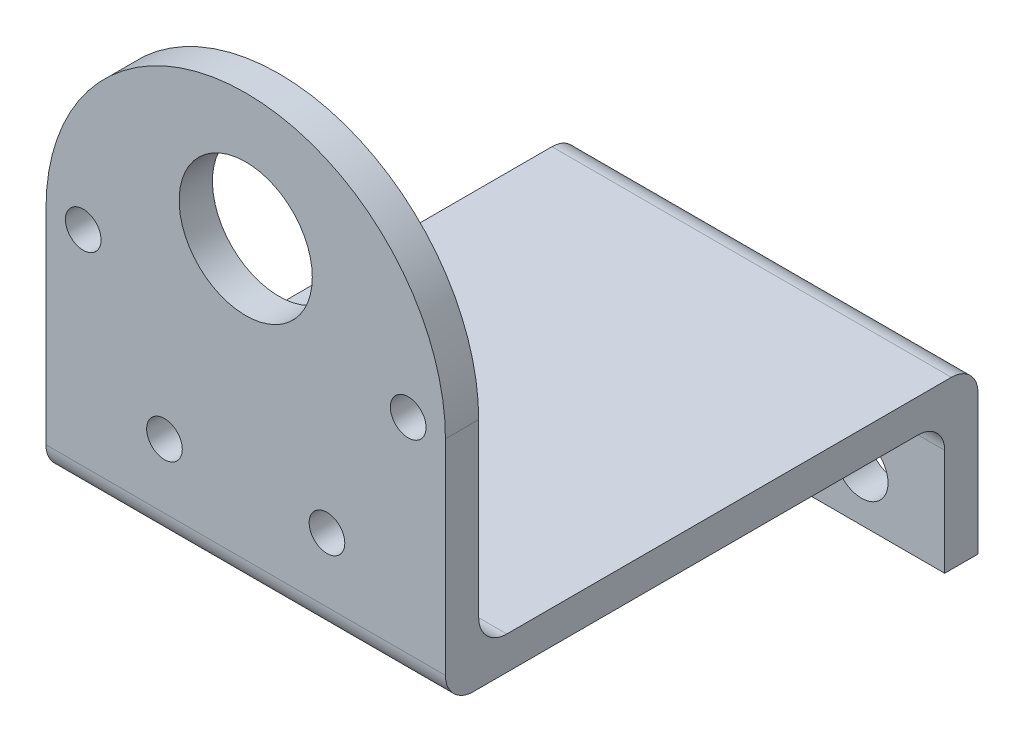
ISO-10303-21;
HEADER;
FILE_DESCRIPTION(('STEP AP214'),'2;1');
FILE_NAME('part.step','',(''),(''),'','','');
FILE_SCHEMA(('AUTOMOTIVE_DESIGN { 1 0 10303 214 1 1 1 1 }'));
ENDSEC;
DATA;
#1=APPLICATION_CONTEXT('core data for automotive mechanical design processes');
#2=APPLICATION_PROTOCOL_DEFINITION('international standard','automotive_design',2000,#1);
#3=PRODUCT_CONTEXT('',#1,'mechanical');
#4=PRODUCT('Part','Part','',(#3));
#5=PRODUCT_RELATED_PRODUCT_CATEGORY('part','',(#4));
#6=PRODUCT_DEFINITION_FORMATION('','',#4);
#7=PRODUCT_DEFINITION_CONTEXT('part definition',#1,'design');
#8=PRODUCT_DEFINITION('design','',#6,#7);
#9=PRODUCT_DEFINITION_SHAPE('','',#8);
#10=(LENGTH_UNIT() NAMED_UNIT(*) SI_UNIT(.MILLI.,.METRE.));
#11=(NAMED_UNIT(*) PLANE_ANGLE_UNIT() SI_UNIT($,.RADIAN.));
#12=(NAMED_UNIT(*) SI_UNIT($,.STERADIAN.) SOLID_ANGLE_UNIT());
#13=UNCERTAINTY_MEASURE_WITH_UNIT(LENGTH_MEASURE(1.E-05),#10,'distance_accuracy_value','');
#14=(GEOMETRIC_REPRESENTATION_CONTEXT(3) GLOBAL_UNCERTAINTY_ASSIGNED_CONTEXT((#13)) GLOBAL_UNIT_ASSIGNED_CONTEXT((#10,
#11,#12)) REPRESENTATION_CONTEXT('',''));
#15=CARTESIAN_POINT('',(0.,0.,0.));
#16=DIRECTION('',(0.,0.,1.));
#17=DIRECTION('',(1.,0.,0.));
#18=AXIS2_PLACEMENT_3D('',#15,#16,#17);
#19=CARTESIAN_POINT('',(38.1,42.094372260743,3.175));
#20=DIRECTION('',(0.,0.,-1.));
#21=DIRECTION('',(0.,1.,0.));
#22=AXIS2_PLACEMENT_3D('',#19,#20,#21);
#23=PLANE('',#22);
#24=CARTESIAN_POINT('',(3.55000000000001,23.044372260743,3.175));
#25=DIRECTION('',(0.,0.,1.));
#26=DIRECTION('',(1.,0.,0.));
#27=AXIS2_PLACEMENT_3D('',#24,#25,#26);
#28=CIRCLE('',#27,1.69999999999999);
#29=CARTESIAN_POINT('',(5.25,23.044372260743,3.175));
#30=VERTEX_POINT('',#29);
#31=EDGE_CURVE('E356',#30,#30,#28,.T.);
#32=ORIENTED_EDGE('',*,*,#31,.F.);
#33=EDGE_LOOP('',(#32));
#34=FACE_BOUND('',#33,.T.);
#35=CARTESIAN_POINT('',(26.8000000000001,9.62097850208426,3.175));
#36=DIRECTION('',(0.,0.,1.));
#37=DIRECTION('',(1.,0.,0.));
#38=AXIS2_PLACEMENT_3D('',#35,#36,#37);
#39=CIRCLE('',#38,1.69999999999999);
#40=CARTESIAN_POINT('',(28.5,9.62097850208426,3.175));
#41=VERTEX_POINT('',#40);
#42=EDGE_CURVE('E360',#41,#41,#39,.T.);
#43=ORIENTED_EDGE('',*,*,#42,.F.);
#44=EDGE_LOOP('',(#43));
#45=FACE_BOUND('',#44,.T.);
#46=CARTESIAN_POINT('',(11.3,9.62097850208421,3.175));
#47=DIRECTION('',(0.,0.,1.));
#48=DIRECTION('',(1.,0.,0.));
#49=AXIS2_PLACEMENT_3D('',#46,#47,#48);
#50=CIRCLE('',#49,1.69999999999999);
#51=CARTESIAN_POINT('',(13.,9.62097850208421,3.175));
#52=VERTEX_POINT('',#51);
#53=EDGE_CURVE('E270',#52,#52,#50,.T.);
#54=ORIENTED_EDGE('',*,*,#53,.F.);
#55=EDGE_LOOP('',(#54));
#56=FACE_BOUND('',#55,.T.);
#57=CARTESIAN_POINT('',(19.05,30.044372230743,3.17499999999999));
#58=DIRECTION('',(0.,0.,1.));
#59=DIRECTION('',(1.,0.,0.));
#60=AXIS2_PLACEMENT_3D('',#57,#58,#59);
#61=CIRCLE('',#60,6.35000000877115);
#62=CARTESIAN_POINT('',(25.4000000087711,30.044372230743,3.17499999999999));
#63=VERTEX_POINT('',#62);
#64=EDGE_CURVE('E259',#63,#63,#61,.T.);
#65=ORIENTED_EDGE('',*,*,#64,.F.);
#66=EDGE_LOOP('',(#65));
#67=FACE_BOUND('',#66,.T.);
#68=DIRECTION('',(0.,-1.,0.));
#69=VECTOR('',#68,1.);
#70=CARTESIAN_POINT('',(38.1,42.094372260743,3.175));
#71=LINE('',#70,#69);
#72=CARTESIAN_POINT('',(38.1,23.044372260743,3.17499999999999));
#73=VERTEX_POINT('',#72);
#74=CARTESIAN_POINT('',(38.1,3.50032880236569,3.17499999999999));
#75=VERTEX_POINT('',#74);
#76=EDGE_CURVE('E158',#73,#75,#71,.T.);
#77=ORIENTED_EDGE('',*,*,#76,.F.);
#78=CARTESIAN_POINT('',(19.05,23.044372260743,3.17499999999999));
#79=DIRECTION('',(0.,0.,1.));
#80=DIRECTION('',(1.,0.,0.));
#81=AXIS2_PLACEMENT_3D('',#78,#79,#80);
#82=CIRCLE('',#81,19.05);
#83=CARTESIAN_POINT('',(0.,23.044372260743,3.17499999999999));
#84=VERTEX_POINT('',#83);
#85=EDGE_CURVE('E258',#73,#84,#82,.T.);
#86=ORIENTED_EDGE('',*,*,#85,.T.);
#87=DIRECTION('',(0.,-1.,0.));
#88=VECTOR('',#87,1.);
#89=CARTESIAN_POINT('',(0.,42.094372260743,3.175));
#90=LINE('',#89,#88);
#91=CARTESIAN_POINT('',(0.,3.50032880236569,3.17499999999999));
#92=VERTEX_POINT('',#91);
#93=EDGE_CURVE('E213',#84,#92,#90,.T.);
#94=ORIENTED_EDGE('',*,*,#93,.T.);
#95=DIRECTION('',(-1.,0.,0.));
#96=VECTOR('',#95,1.);
#97=CARTESIAN_POINT('',(38.1,3.50032880236569,3.17499999999999));
#98=LINE('',#97,#96);
#99=EDGE_CURVE('E253',#75,#92,#98,.T.);
#100=ORIENTED_EDGE('',*,*,#99,.F.);
#101=EDGE_LOOP('',(#77,#86,#94,#100));
#102=FACE_BOUND('',#101,.T.);
#103=CARTESIAN_POINT('',(34.55,23.0443722607431,3.175));
#104=DIRECTION('',(0.,0.,1.));
#105=DIRECTION('',(1.,0.,0.));
#106=AXIS2_PLACEMENT_3D('',#103,#104,#105);
#107=CIRCLE('',#106,1.69999999999999);
#108=CARTESIAN_POINT('',(36.25,23.0443722607431,3.175));
#109=VERTEX_POINT('',#108);
#110=EDGE_CURVE('E370',#109,#109,#107,.T.);
#111=ORIENTED_EDGE('',*,*,#110,.F.);
#112=EDGE_LOOP('',(#111));
#113=FACE_BOUND('',#112,.T.);
#114=ADVANCED_FACE('F87',(#34,#45,#56,#67,#102,#113),#23,.F.);
#115=CARTESIAN_POINT('',(38.1,42.094372260743,0.));
#116=DIRECTION('',(0.,0.,-1.));
#117=DIRECTION('',(0.,1.,0.));
#118=AXIS2_PLACEMENT_3D('',#115,#116,#117);
#119=PLANE('',#118);
#120=CARTESIAN_POINT('',(3.55000000000001,23.044372260743,0.));
#121=DIRECTION('',(0.,0.,-1.));
#122=DIRECTION('',(0.,1.,0.));
#123=AXIS2_PLACEMENT_3D('',#120,#121,#122);
#124=CIRCLE('',#123,1.69999999999999);
#125=CARTESIAN_POINT('',(3.55000000000001,24.744372260743,0.));
#126=VERTEX_POINT('',#125);
#127=EDGE_CURVE('E373',#126,#126,#124,.T.);
#128=ORIENTED_EDGE('',*,*,#127,.F.);
#129=EDGE_LOOP('',(#128));
#130=FACE_BOUND('',#129,.T.);
#131=CARTESIAN_POINT('',(34.55,23.0443722607431,0.));
#132=DIRECTION('',(0.,0.,-1.));
#133=DIRECTION('',(0.,1.,0.));
#134=AXIS2_PLACEMENT_3D('',#131,#132,#133);
#135=CIRCLE('',#134,1.69999999999999);
#136=CARTESIAN_POINT('',(34.55,24.7443722607431,0.));
#137=VERTEX_POINT('',#136);
#138=EDGE_CURVE('E90',#137,#137,#135,.T.);
#139=ORIENTED_EDGE('',*,*,#138,.F.);
#140=EDGE_LOOP('',(#139));
#141=FACE_BOUND('',#140,.T.);
#142=CARTESIAN_POINT('',(26.8000000000001,9.62097850208426,0.));
#143=DIRECTION('',(0.,0.,-1.));
#144=DIRECTION('',(0.,1.,0.));
#145=AXIS2_PLACEMENT_3D('',#142,#143,#144);
#146=CIRCLE('',#145,1.69999999999999);
#147=CARTESIAN_POINT('',(26.8000000000001,11.3209785020842,0.));
#148=VERTEX_POINT('',#147);
#149=EDGE_CURVE('E365',#148,#148,#146,.T.);
#150=ORIENTED_EDGE('',*,*,#149,.F.);
#151=EDGE_LOOP('',(#150));
#152=FACE_BOUND('',#151,.T.);
#153=CARTESIAN_POINT('',(11.3,9.62097850208421,0.));
#154=DIRECTION('',(0.,0.,-1.));
#155=DIRECTION('',(0.,1.,0.));
#156=AXIS2_PLACEMENT_3D('',#153,#154,#155);
#157=CIRCLE('',#156,1.69999999999999);
#158=CARTESIAN_POINT('',(11.3,11.3209785020842,0.));
#159=VERTEX_POINT('',#158);
#160=EDGE_CURVE('E265',#159,#159,#157,.T.);
#161=ORIENTED_EDGE('',*,*,#160,.F.);
#162=EDGE_LOOP('',(#161));
#163=FACE_BOUND('',#162,.T.);
#164=CARTESIAN_POINT('',(19.05,30.044372230743,0.));
#165=DIRECTION('',(0.,0.,-1.));
#166=DIRECTION('',(0.,1.,0.));
#167=AXIS2_PLACEMENT_3D('',#164,#165,#166);
#168=CIRCLE('',#167,6.35000000877115);
#169=CARTESIAN_POINT('',(19.05,36.3943722395142,0.));
#170=VERTEX_POINT('',#169);
#171=EDGE_CURVE('E256',#170,#170,#168,.T.);
#172=ORIENTED_EDGE('',*,*,#171,.F.);
#173=EDGE_LOOP('',(#172));
#174=FACE_BOUND('',#173,.T.);
#175=CARTESIAN_POINT('',(19.05,23.044372260743,0.));
#176=DIRECTION('',(0.,0.,-1.));
#177=DIRECTION('',(0.,1.,0.));
#178=AXIS2_PLACEMENT_3D('',#175,#176,#177);
#179=CIRCLE('',#178,19.05);
#180=CARTESIAN_POINT('',(0.,23.044372260743,0.));
#181=VERTEX_POINT('',#180);
#182=CARTESIAN_POINT('',(38.1,23.044372260743,0.));
#183=VERTEX_POINT('',#182);
#184=EDGE_CURVE('E103',#181,#183,#179,.T.);
#185=ORIENTED_EDGE('',*,*,#184,.T.);
#186=DIRECTION('',(0.,-1.,0.));
#187=VECTOR('',#186,1.);
#188=CARTESIAN_POINT('',(38.1,42.094372260743,0.));
#189=LINE('',#188,#187);
#190=CARTESIAN_POINT('',(38.1,6.6753288023657,0.));
#191=VERTEX_POINT('',#190);
#192=EDGE_CURVE('E111',#183,#191,#189,.T.);
#193=ORIENTED_EDGE('',*,*,#192,.T.);
#194=DIRECTION('',(-1.,0.,0.));
#195=VECTOR('',#194,1.);
#196=CARTESIAN_POINT('',(38.1,6.6753288023657,0.));
#197=LINE('',#196,#195);
#198=CARTESIAN_POINT('',(0.,6.6753288023657,0.));
#199=VERTEX_POINT('',#198);
#200=EDGE_CURVE('E212',#191,#199,#197,.T.);
#201=ORIENTED_EDGE('',*,*,#200,.T.);
#202=DIRECTION('',(0.,-1.,0.));
#203=VECTOR('',#202,1.);
#204=CARTESIAN_POINT('',(0.,42.094372260743,0.));
#205=LINE('',#204,#203);
#206=EDGE_CURVE('E151',#181,#199,#205,.T.);
#207=ORIENTED_EDGE('',*,*,#206,.F.);
#208=EDGE_LOOP('',(#185,#193,#201,#207));
#209=FACE_BOUND('',#208,.T.);
#210=ADVANCED_FACE('F346',(#130,#141,#152,#163,#174,#209),#119,.T.);
#211=CARTESIAN_POINT('',(38.1,3.50032880236569,0.494043458377322));
#212=DIRECTION('',(1.,0.,0.));
#213=DIRECTION('',(0.,0.,-1.));
#214=AXIS2_PLACEMENT_3D('',#211,#212,#213);
#215=PLANE('',#214);
#216=ORIENTED_EDGE('',*,*,#192,.F.);
#217=DIRECTION('',(0.,0.,1.));
#218=VECTOR('',#217,1.);
#219=CARTESIAN_POINT('',(38.1,23.044372260743,-47.625));
#220=LINE('',#219,#218);
#221=EDGE_CURVE('E12',#183,#73,#220,.T.);
#222=ORIENTED_EDGE('',*,*,#221,.T.);
#223=ORIENTED_EDGE('',*,*,#76,.T.);
#224=CARTESIAN_POINT('',(38.1,3.50032880236569,0.494043458377322));
#225=DIRECTION('',(1.,0.,0.));
#226=DIRECTION('',(0.,0.,-1.));
#227=AXIS2_PLACEMENT_3D('',#224,#225,#226);
#228=CIRCLE('',#227,2.68095654162267);
#229=CARTESIAN_POINT('',(38.1,0.81937226074302,0.494043458377322));
#230=VERTEX_POINT('',#229);
#231=EDGE_CURVE('E287',#75,#230,#228,.T.);
#232=ORIENTED_EDGE('',*,*,#231,.T.);
#233=DIRECTION('',(0.,0.,-1.));
#234=VECTOR('',#233,1.);
#235=CARTESIAN_POINT('',(38.1,0.81937226074302,0.494043458377322));
#236=LINE('',#235,#234);
#237=CARTESIAN_POINT('',(38.1,0.819372260743024,-41.91));
#238=VERTEX_POINT('',#237);
#239=EDGE_CURVE('E289',#230,#238,#236,.T.);
#240=ORIENTED_EDGE('',*,*,#239,.T.);
#241=CARTESIAN_POINT('',(38.1,-1.72062773925698,-41.91));
#242=DIRECTION('',(-1.,0.,0.));
#243=DIRECTION('',(0.,0.,1.));
#244=AXIS2_PLACEMENT_3D('',#241,#242,#243);
#245=CIRCLE('',#244,2.54);
#246=CARTESIAN_POINT('',(38.1,-1.72062773925698,-44.45));
#247=VERTEX_POINT('',#246);
#248=EDGE_CURVE('E291',#238,#247,#245,.T.);
#249=ORIENTED_EDGE('',*,*,#248,.T.);
#250=DIRECTION('',(0.,1.,0.));
#251=VECTOR('',#250,1.);
#252=CARTESIAN_POINT('',(38.1,-11.880627739257,-44.45));
#253=LINE('',#252,#251);
#254=CARTESIAN_POINT('',(38.1,-11.880627739257,-44.45));
#255=VERTEX_POINT('',#254);
#256=EDGE_CURVE('E293',#255,#247,#253,.T.);
#257=ORIENTED_EDGE('',*,*,#256,.F.);
#258=DIRECTION('',(0.,0.,1.));
#259=VECTOR('',#258,1.);
#260=CARTESIAN_POINT('',(38.1,-11.880627739257,-47.625));
#261=LINE('',#260,#259);
#262=CARTESIAN_POINT('',(38.1,-11.880627739257,-47.625));
#263=VERTEX_POINT('',#262);
#264=EDGE_CURVE('E296',#263,#255,#261,.T.);
#265=ORIENTED_EDGE('',*,*,#264,.F.);
#266=DIRECTION('',(0.,-1.,0.));
#267=VECTOR('',#266,1.);
#268=CARTESIAN_POINT('',(38.1,1.45437226074302,-47.625));
#269=LINE('',#268,#267);
#270=CARTESIAN_POINT('',(38.1,1.45437226074302,-47.625));
#271=VERTEX_POINT('',#270);
#272=EDGE_CURVE('E203',#271,#263,#269,.T.);
#273=ORIENTED_EDGE('',*,*,#272,.F.);
#274=CARTESIAN_POINT('',(38.1,1.45437226074302,-45.085));
#275=DIRECTION('',(-1.,0.,0.));
#276=DIRECTION('',(0.,0.,1.));
#277=AXIS2_PLACEMENT_3D('',#274,#275,#276);
#278=CIRCLE('',#277,2.54);
#279=CARTESIAN_POINT('',(38.1,3.99437226074302,-45.085));
#280=VERTEX_POINT('',#279);
#281=EDGE_CURVE('E185',#280,#271,#278,.T.);
#282=ORIENTED_EDGE('',*,*,#281,.F.);
#283=DIRECTION('',(0.,0.,-1.));
#284=VECTOR('',#283,1.);
#285=CARTESIAN_POINT('',(38.1,3.99437226074302,-2.68095654162268));
#286=LINE('',#285,#284);
#287=CARTESIAN_POINT('',(38.1,3.99437226074302,-2.68095654162268));
#288=VERTEX_POINT('',#287);
#289=EDGE_CURVE('E199',#288,#280,#286,.T.);
#290=ORIENTED_EDGE('',*,*,#289,.F.);
#291=CARTESIAN_POINT('',(38.1,6.6753288023657,-2.68095654162268));
#292=DIRECTION('',(1.,0.,0.));
#293=DIRECTION('',(0.,0.,-1.));
#294=AXIS2_PLACEMENT_3D('',#291,#292,#293);
#295=CIRCLE('',#294,2.68095654162267);
#296=EDGE_CURVE('E206',#191,#288,#295,.T.);
#297=ORIENTED_EDGE('',*,*,#296,.F.);
#298=EDGE_LOOP('',(#216,#222,#223,#232,#240,#249,#257,#265,#273,#282,#290,#297));
#299=FACE_BOUND('',#298,.T.);
#300=ADVANCED_FACE('F197',(#299),#215,.T.);
#301=CARTESIAN_POINT('',(0.,3.50032880236569,0.494043458377322));
#302=DIRECTION('',(1.,0.,0.));
#303=DIRECTION('',(0.,0.,-1.));
#304=AXIS2_PLACEMENT_3D('',#301,#302,#303);
#305=PLANE('',#304);
#306=DIRECTION('',(0.,0.,1.));
#307=VECTOR('',#306,1.);
#308=CARTESIAN_POINT('',(0.,23.044372260743,-47.625));
#309=LINE('',#308,#307);
#310=EDGE_CURVE('E95',#181,#84,#309,.T.);
#311=ORIENTED_EDGE('',*,*,#310,.F.);
#312=ORIENTED_EDGE('',*,*,#206,.T.);
#313=CARTESIAN_POINT('',(0.,6.6753288023657,-2.68095654162268));
#314=DIRECTION('',(1.,0.,0.));
#315=DIRECTION('',(0.,0.,-1.));
#316=AXIS2_PLACEMENT_3D('',#313,#314,#315);
#317=CIRCLE('',#316,2.68095654162267);
#318=CARTESIAN_POINT('',(0.,3.99437226074302,-2.68095654162268));
#319=VERTEX_POINT('',#318);
#320=EDGE_CURVE('E235',#199,#319,#317,.T.);
#321=ORIENTED_EDGE('',*,*,#320,.T.);
#322=DIRECTION('',(0.,0.,-1.));
#323=VECTOR('',#322,1.);
#324=CARTESIAN_POINT('',(0.,3.99437226074302,-2.68095654162268));
#325=LINE('',#324,#323);
#326=CARTESIAN_POINT('',(0.,3.99437226074302,-45.085));
#327=VERTEX_POINT('',#326);
#328=EDGE_CURVE('E233',#319,#327,#325,.T.);
#329=ORIENTED_EDGE('',*,*,#328,.T.);
#330=CARTESIAN_POINT('',(0.,1.45437226074302,-45.085));
#331=DIRECTION('',(-1.,0.,0.));
#332=DIRECTION('',(0.,0.,1.));
#333=AXIS2_PLACEMENT_3D('',#330,#331,#332);
#334=CIRCLE('',#333,2.54);
#335=CARTESIAN_POINT('',(0.,1.45437226074302,-47.625));
#336=VERTEX_POINT('',#335);
#337=EDGE_CURVE('E187',#327,#336,#334,.T.);
#338=ORIENTED_EDGE('',*,*,#337,.T.);
#339=DIRECTION('',(0.,-1.,0.));
#340=VECTOR('',#339,1.);
#341=CARTESIAN_POINT('',(0.,1.45437226074302,-47.625));
#342=LINE('',#341,#340);
#343=CARTESIAN_POINT('',(0.,-11.880627739257,-47.625));
#344=VERTEX_POINT('',#343);
#345=EDGE_CURVE('E229',#336,#344,#342,.T.);
#346=ORIENTED_EDGE('',*,*,#345,.T.);
#347=DIRECTION('',(0.,0.,1.));
#348=VECTOR('',#347,1.);
#349=CARTESIAN_POINT('',(0.,-11.880627739257,-47.625));
#350=LINE('',#349,#348);
#351=CARTESIAN_POINT('',(0.,-11.880627739257,-44.45));
#352=VERTEX_POINT('',#351);
#353=EDGE_CURVE('E226',#344,#352,#350,.T.);
#354=ORIENTED_EDGE('',*,*,#353,.T.);
#355=DIRECTION('',(0.,1.,0.));
#356=VECTOR('',#355,1.);
#357=CARTESIAN_POINT('',(0.,-11.880627739257,-44.45));
#358=LINE('',#357,#356);
#359=CARTESIAN_POINT('',(0.,-1.72062773925698,-44.45));
#360=VERTEX_POINT('',#359);
#361=EDGE_CURVE('E223',#352,#360,#358,.T.);
#362=ORIENTED_EDGE('',*,*,#361,.T.);
#363=CARTESIAN_POINT('',(0.,-1.72062773925698,-41.91));
#364=DIRECTION('',(-1.,0.,0.));
#365=DIRECTION('',(0.,0.,1.));
#366=AXIS2_PLACEMENT_3D('',#363,#364,#365);
#367=CIRCLE('',#366,2.54);
#368=CARTESIAN_POINT('',(0.,0.819372260743024,-41.91));
#369=VERTEX_POINT('',#368);
#370=EDGE_CURVE('E220',#369,#360,#367,.T.);
#371=ORIENTED_EDGE('',*,*,#370,.F.);
#372=DIRECTION('',(0.,0.,-1.));
#373=VECTOR('',#372,1.);
#374=CARTESIAN_POINT('',(0.,0.81937226074302,0.494043458377322));
#375=LINE('',#374,#373);
#376=CARTESIAN_POINT('',(0.,0.81937226074302,0.494043458377322));
#377=VERTEX_POINT('',#376);
#378=EDGE_CURVE('E218',#377,#369,#375,.T.);
#379=ORIENTED_EDGE('',*,*,#378,.F.);
#380=CARTESIAN_POINT('',(0.,3.50032880236569,0.494043458377322));
#381=DIRECTION('',(1.,0.,0.));
#382=DIRECTION('',(0.,0.,-1.));
#383=AXIS2_PLACEMENT_3D('',#380,#381,#382);
#384=CIRCLE('',#383,2.68095654162267);
#385=EDGE_CURVE('E215',#92,#377,#384,.T.);
#386=ORIENTED_EDGE('',*,*,#385,.F.);
#387=ORIENTED_EDGE('',*,*,#93,.F.);
#388=EDGE_LOOP('',(#311,#312,#321,#329,#338,#346,#354,#362,#371,#379,#386,#387));
#389=FACE_BOUND('',#388,.T.);
#390=ADVANCED_FACE('F302',(#389),#305,.F.);
#391=CARTESIAN_POINT('',(38.1,3.50032880236569,0.494043458377322));
#392=DIRECTION('',(-1.,0.,0.));
#393=DIRECTION('',(0.,0.,1.));
#394=AXIS2_PLACEMENT_3D('',#391,#392,#393);
#395=CYLINDRICAL_SURFACE('',#394,2.68095654162267);
#396=ORIENTED_EDGE('',*,*,#385,.T.);
#397=DIRECTION('',(-1.,0.,0.));
#398=VECTOR('',#397,1.);
#399=CARTESIAN_POINT('',(38.1,0.81937226074302,0.494043458377322));
#400=LINE('',#399,#398);
#401=EDGE_CURVE('E250',#230,#377,#400,.T.);
#402=ORIENTED_EDGE('',*,*,#401,.F.);
#403=ORIENTED_EDGE('',*,*,#231,.F.);
#404=ORIENTED_EDGE('',*,*,#99,.T.);
#405=EDGE_LOOP('',(#396,#402,#403,#404));
#406=FACE_BOUND('',#405,.T.);
#407=ADVANCED_FACE('F319',(#406),#395,.T.);
#408=CARTESIAN_POINT('',(38.1,0.81937226074302,0.494043458377322));
#409=DIRECTION('',(0.,1.,0.));
#410=DIRECTION('',(0.,0.,1.));
#411=AXIS2_PLACEMENT_3D('',#408,#409,#410);
#412=PLANE('',#411);
#413=ORIENTED_EDGE('',*,*,#378,.T.);
#414=DIRECTION('',(-1.,0.,0.));
#415=VECTOR('',#414,1.);
#416=CARTESIAN_POINT('',(38.1,0.819372260743024,-41.91));
#417=LINE('',#416,#415);
#418=EDGE_CURVE('E247',#238,#369,#417,.T.);
#419=ORIENTED_EDGE('',*,*,#418,.F.);
#420=ORIENTED_EDGE('',*,*,#239,.F.);
#421=ORIENTED_EDGE('',*,*,#401,.T.);
#422=EDGE_LOOP('',(#413,#419,#420,#421));
#423=FACE_BOUND('',#422,.T.);
#424=ADVANCED_FACE('F323',(#423),#412,.F.);
#425=CARTESIAN_POINT('',(38.1,-1.72062773925698,-41.91));
#426=DIRECTION('',(-1.,0.,0.));
#427=DIRECTION('',(0.,0.,1.));
#428=AXIS2_PLACEMENT_3D('',#425,#426,#427);
#429=CYLINDRICAL_SURFACE('',#428,2.54);
#430=ORIENTED_EDGE('',*,*,#370,.T.);
#431=DIRECTION('',(-1.,0.,0.));
#432=VECTOR('',#431,1.);
#433=CARTESIAN_POINT('',(38.1,-1.72062773925698,-44.45));
#434=LINE('',#433,#432);
#435=EDGE_CURVE('E245',#247,#360,#434,.T.);
#436=ORIENTED_EDGE('',*,*,#435,.F.);
#437=ORIENTED_EDGE('',*,*,#248,.F.);
#438=ORIENTED_EDGE('',*,*,#418,.T.);
#439=EDGE_LOOP('',(#430,#436,#437,#438));
#440=FACE_BOUND('',#439,.T.);
#441=ADVANCED_FACE('F329',(#440),#429,.F.);
#442=CARTESIAN_POINT('',(38.1,-11.880627739257,-44.45));
#443=DIRECTION('',(0.,0.,1.));
#444=DIRECTION('',(0.,-1.,0.));
#445=AXIS2_PLACEMENT_3D('',#442,#443,#444);
#446=PLANE('',#445);
#447=CARTESIAN_POINT('',(7.9375,-7.11812773925698,-44.45));
#448=DIRECTION('',(0.,0.,1.));
#449=DIRECTION('',(1.,0.,0.));
#450=AXIS2_PLACEMENT_3D('',#447,#448,#449);
#451=CIRCLE('',#450,2.52729999999999);
#452=CARTESIAN_POINT('',(10.4648,-7.11812773925698,-44.45));
#453=VERTEX_POINT('',#452);
#454=EDGE_CURVE('E275',#453,#453,#451,.T.);
#455=ORIENTED_EDGE('',*,*,#454,.F.);
#456=EDGE_LOOP('',(#455));
#457=FACE_BOUND('',#456,.T.);
#458=CARTESIAN_POINT('',(30.1625,-7.11812773925698,-44.45));
#459=DIRECTION('',(0.,0.,1.));
#460=DIRECTION('',(1.,0.,0.));
#461=AXIS2_PLACEMENT_3D('',#458,#459,#460);
#462=CIRCLE('',#461,2.52729999999999);
#463=CARTESIAN_POINT('',(32.6898,-7.11812773925698,-44.45));
#464=VERTEX_POINT('',#463);
#465=EDGE_CURVE('E281',#464,#464,#462,.T.);
#466=ORIENTED_EDGE('',*,*,#465,.F.);
#467=EDGE_LOOP('',(#466));
#468=FACE_BOUND('',#467,.T.);
#469=ORIENTED_EDGE('',*,*,#361,.F.);
#470=DIRECTION('',(-1.,0.,0.));
#471=VECTOR('',#470,1.);
#472=CARTESIAN_POINT('',(38.1,-11.880627739257,-44.45));
#473=LINE('',#472,#471);
#474=EDGE_CURVE('E243',#255,#352,#473,.T.);
#475=ORIENTED_EDGE('',*,*,#474,.F.);
#476=ORIENTED_EDGE('',*,*,#256,.T.);
#477=ORIENTED_EDGE('',*,*,#435,.T.);
#478=EDGE_LOOP('',(#469,#475,#476,#477));
#479=FACE_BOUND('',#478,.T.);
#480=ADVANCED_FACE('F332',(#457,#468,#479),#446,.T.);
#481=CARTESIAN_POINT('',(38.1,-11.880627739257,-47.625));
#482=DIRECTION('',(0.,-1.,0.));
#483=DIRECTION('',(0.,0.,-1.));
#484=AXIS2_PLACEMENT_3D('',#481,#482,#483);
#485=PLANE('',#484);
#486=ORIENTED_EDGE('',*,*,#353,.F.);
#487=DIRECTION('',(-1.,0.,0.));
#488=VECTOR('',#487,1.);
#489=CARTESIAN_POINT('',(38.1,-11.880627739257,-47.625));
#490=LINE('',#489,#488);
#491=EDGE_CURVE('E241',#263,#344,#490,.T.);
#492=ORIENTED_EDGE('',*,*,#491,.F.);
#493=ORIENTED_EDGE('',*,*,#264,.T.);
#494=ORIENTED_EDGE('',*,*,#474,.T.);
#495=EDGE_LOOP('',(#486,#492,#493,#494));
#496=FACE_BOUND('',#495,.T.);
#497=ADVANCED_FACE('F334',(#496),#485,.T.);
#498=CARTESIAN_POINT('',(38.1,1.45437226074302,-47.625));
#499=DIRECTION('',(0.,0.,-1.));
#500=DIRECTION('',(-1.,0.,0.));
#501=AXIS2_PLACEMENT_3D('',#498,#499,#500);
#502=PLANE('',#501);
#503=CARTESIAN_POINT('',(7.9375,-7.11812773925698,-47.625));
#504=DIRECTION('',(0.,0.,1.));
#505=DIRECTION('',(1.,0.,0.));
#506=AXIS2_PLACEMENT_3D('',#503,#504,#505);
#507=CIRCLE('',#506,2.5273);
#508=CARTESIAN_POINT('',(10.4648,-7.11812773925698,-47.625));
#509=VERTEX_POINT('',#508);
#510=EDGE_CURVE('E278',#509,#509,#507,.T.);
#511=ORIENTED_EDGE('',*,*,#510,.T.);
#512=EDGE_LOOP('',(#511));
#513=FACE_BOUND('',#512,.T.);
#514=CARTESIAN_POINT('',(30.1625,-7.11812773925698,-47.625));
#515=DIRECTION('',(0.,0.,1.));
#516=DIRECTION('',(1.,0.,0.));
#517=AXIS2_PLACEMENT_3D('',#514,#515,#516);
#518=CIRCLE('',#517,2.5273);
#519=CARTESIAN_POINT('',(32.6898,-7.11812773925698,-47.625));
#520=VERTEX_POINT('',#519);
#521=EDGE_CURVE('E216',#520,#520,#518,.T.);
#522=ORIENTED_EDGE('',*,*,#521,.T.);
#523=EDGE_LOOP('',(#522));
#524=FACE_BOUND('',#523,.T.);
#525=ORIENTED_EDGE('',*,*,#345,.F.);
#526=DIRECTION('',(-1.,0.,0.));
#527=VECTOR('',#526,1.);
#528=CARTESIAN_POINT('',(38.1,1.45437226074302,-47.625));
#529=LINE('',#528,#527);
#530=EDGE_CURVE('E192',#271,#336,#529,.T.);
#531=ORIENTED_EDGE('',*,*,#530,.F.);
#532=ORIENTED_EDGE('',*,*,#272,.T.);
#533=ORIENTED_EDGE('',*,*,#491,.T.);
#534=EDGE_LOOP('',(#525,#531,#532,#533));
#535=FACE_BOUND('',#534,.T.);
#536=ADVANCED_FACE('F300',(#513,#524,#535),#502,.T.);
#537=CARTESIAN_POINT('',(38.1,1.45437226074302,-45.085));
#538=DIRECTION('',(-1.,0.,0.));
#539=DIRECTION('',(0.,0.,1.));
#540=AXIS2_PLACEMENT_3D('',#537,#538,#539);
#541=CYLINDRICAL_SURFACE('',#540,2.54);
#542=ORIENTED_EDGE('',*,*,#337,.F.);
#543=DIRECTION('',(-1.,0.,0.));
#544=VECTOR('',#543,1.);
#545=CARTESIAN_POINT('',(38.1,3.99437226074302,-45.085));
#546=LINE('',#545,#544);
#547=EDGE_CURVE('E182',#280,#327,#546,.T.);
#548=ORIENTED_EDGE('',*,*,#547,.F.);
#549=ORIENTED_EDGE('',*,*,#281,.T.);
#550=ORIENTED_EDGE('',*,*,#530,.T.);
#551=EDGE_LOOP('',(#542,#548,#549,#550));
#552=FACE_BOUND('',#551,.T.);
#553=ADVANCED_FACE('F184',(#552),#541,.T.);
#554=CARTESIAN_POINT('',(38.1,3.99437226074302,-2.68095654162268));
#555=DIRECTION('',(0.,1.,0.));
#556=DIRECTION('',(0.,0.,1.));
#557=AXIS2_PLACEMENT_3D('',#554,#555,#556);
#558=PLANE('',#557);
#559=ORIENTED_EDGE('',*,*,#328,.F.);
#560=DIRECTION('',(-1.,0.,0.));
#561=VECTOR('',#560,1.);
#562=CARTESIAN_POINT('',(38.1,3.99437226074302,-2.68095654162268));
#563=LINE('',#562,#561);
#564=EDGE_CURVE('E193',#288,#319,#563,.T.);
#565=ORIENTED_EDGE('',*,*,#564,.F.);
#566=ORIENTED_EDGE('',*,*,#289,.T.);
#567=ORIENTED_EDGE('',*,*,#547,.T.);
#568=EDGE_LOOP('',(#559,#565,#566,#567));
#569=FACE_BOUND('',#568,.T.);
#570=ADVANCED_FACE('F205',(#569),#558,.T.);
#571=CARTESIAN_POINT('',(38.1,6.6753288023657,-2.68095654162268));
#572=DIRECTION('',(-1.,0.,0.));
#573=DIRECTION('',(0.,0.,1.));
#574=AXIS2_PLACEMENT_3D('',#571,#572,#573);
#575=CYLINDRICAL_SURFACE('',#574,2.68095654162267);
#576=ORIENTED_EDGE('',*,*,#320,.F.);
#577=ORIENTED_EDGE('',*,*,#200,.F.);
#578=ORIENTED_EDGE('',*,*,#296,.T.);
#579=ORIENTED_EDGE('',*,*,#564,.T.);
#580=EDGE_LOOP('',(#576,#577,#578,#579));
#581=FACE_BOUND('',#580,.T.);
#582=ADVANCED_FACE('F305',(#581),#575,.F.);
#583=CARTESIAN_POINT('',(30.1625,-7.11812773925698,-44.45));
#584=DIRECTION('',(0.,0.,1.));
#585=DIRECTION('',(1.,0.,0.));
#586=AXIS2_PLACEMENT_3D('',#583,#584,#585);
#587=CYLINDRICAL_SURFACE('',#586,2.52729999999999);
#588=ORIENTED_EDGE('',*,*,#521,.F.);
#589=EDGE_LOOP('',(#588));
#590=FACE_BOUND('',#589,.T.);
#591=ORIENTED_EDGE('',*,*,#465,.T.);
#592=EDGE_LOOP('',(#591));
#593=FACE_BOUND('',#592,.T.);
#594=ADVANCED_FACE('F404',(#590,#593),#587,.F.);
#595=CARTESIAN_POINT('',(7.9375,-7.11812773925698,-44.45));
#596=DIRECTION('',(0.,0.,1.));
#597=DIRECTION('',(1.,0.,0.));
#598=AXIS2_PLACEMENT_3D('',#595,#596,#597);
#599=CYLINDRICAL_SURFACE('',#598,2.52729999999999);
#600=ORIENTED_EDGE('',*,*,#510,.F.);
#601=EDGE_LOOP('',(#600));
#602=FACE_BOUND('',#601,.T.);
#603=ORIENTED_EDGE('',*,*,#454,.T.);
#604=EDGE_LOOP('',(#603));
#605=FACE_BOUND('',#604,.T.);
#606=ADVANCED_FACE('F401',(#602,#605),#599,.F.);
#607=CARTESIAN_POINT('',(19.05,23.044372260743,-47.625));
#608=DIRECTION('',(0.,0.,1.));
#609=DIRECTION('',(1.,0.,0.));
#610=AXIS2_PLACEMENT_3D('',#607,#608,#609);
#611=CYLINDRICAL_SURFACE('',#610,19.05);
#612=ORIENTED_EDGE('',*,*,#310,.T.);
#613=ORIENTED_EDGE('',*,*,#85,.F.);
#614=ORIENTED_EDGE('',*,*,#221,.F.);
#615=ORIENTED_EDGE('',*,*,#184,.F.);
#616=EDGE_LOOP('',(#612,#613,#614,#615));
#617=FACE_BOUND('',#616,.T.);
#618=ADVANCED_FACE('F310',(#617),#611,.T.);
#619=CARTESIAN_POINT('',(19.05,30.044372230743,-47.625));
#620=DIRECTION('',(0.,0.,1.));
#621=DIRECTION('',(1.,0.,0.));
#622=AXIS2_PLACEMENT_3D('',#619,#620,#621);
#623=CYLINDRICAL_SURFACE('',#622,6.35000000877115);
#624=ORIENTED_EDGE('',*,*,#171,.T.);
#625=EDGE_LOOP('',(#624));
#626=FACE_BOUND('',#625,.T.);
#627=ORIENTED_EDGE('',*,*,#64,.T.);
#628=EDGE_LOOP('',(#627));
#629=FACE_BOUND('',#628,.T.);
#630=ADVANCED_FACE('F395',(#626,#629),#623,.F.);
#631=CARTESIAN_POINT('',(11.3,9.62097850208421,3.17499999999999));
#632=DIRECTION('',(0.,0.,1.));
#633=DIRECTION('',(1.,0.,0.));
#634=AXIS2_PLACEMENT_3D('',#631,#632,#633);
#635=CYLINDRICAL_SURFACE('',#634,1.69999999999999);
#636=ORIENTED_EDGE('',*,*,#160,.T.);
#637=EDGE_LOOP('',(#636));
#638=FACE_BOUND('',#637,.T.);
#639=ORIENTED_EDGE('',*,*,#53,.T.);
#640=EDGE_LOOP('',(#639));
#641=FACE_BOUND('',#640,.T.);
#642=ADVANCED_FACE('F391',(#638,#641),#635,.F.);
#643=CARTESIAN_POINT('',(26.8000000000001,9.62097850208426,3.17499999999999));
#644=DIRECTION('',(0.,0.,1.));
#645=DIRECTION('',(1.,0.,0.));
#646=AXIS2_PLACEMENT_3D('',#643,#644,#645);
#647=CYLINDRICAL_SURFACE('',#646,1.69999999999999);
#648=ORIENTED_EDGE('',*,*,#149,.T.);
#649=EDGE_LOOP('',(#648));
#650=FACE_BOUND('',#649,.T.);
#651=ORIENTED_EDGE('',*,*,#42,.T.);
#652=EDGE_LOOP('',(#651));
#653=FACE_BOUND('',#652,.T.);
#654=ADVANCED_FACE('F385',(#650,#653),#647,.F.);
#655=CARTESIAN_POINT('',(34.55,23.0443722607431,3.17499999999999));
#656=DIRECTION('',(0.,0.,1.));
#657=DIRECTION('',(1.,0.,0.));
#658=AXIS2_PLACEMENT_3D('',#655,#656,#657);
#659=CYLINDRICAL_SURFACE('',#658,1.69999999999999);
#660=ORIENTED_EDGE('',*,*,#138,.T.);
#661=EDGE_LOOP('',(#660));
#662=FACE_BOUND('',#661,.T.);
#663=ORIENTED_EDGE('',*,*,#110,.T.);
#664=EDGE_LOOP('',(#663));
#665=FACE_BOUND('',#664,.T.);
#666=ADVANCED_FACE('F379',(#662,#665),#659,.F.);
#667=CARTESIAN_POINT('',(3.55000000000001,23.044372260743,3.17499999999999));
#668=DIRECTION('',(0.,0.,1.));
#669=DIRECTION('',(1.,0.,0.));
#670=AXIS2_PLACEMENT_3D('',#667,#668,#669);
#671=CYLINDRICAL_SURFACE('',#670,1.69999999999999);
#672=ORIENTED_EDGE('',*,*,#127,.T.);
#673=EDGE_LOOP('',(#672));
#674=FACE_BOUND('',#673,.T.);
#675=ORIENTED_EDGE('',*,*,#31,.T.);
#676=EDGE_LOOP('',(#675));
#677=FACE_BOUND('',#676,.T.);
#678=ADVANCED_FACE('F377',(#674,#677),#671,.F.);
#679=CLOSED_SHELL('',(#114,#210,#300,#390,#407,#424,#441,#480,#497,#536,#553,#570,#582,#594,
#606,#618,#630,#642,#654,#666,#678));
#680=MANIFOLD_SOLID_BREP('B2',#679);
#681=ADVANCED_BREP_SHAPE_REPRESENTATION('',(#18,#680),#14);
#682=SHAPE_DEFINITION_REPRESENTATION(#9,#681);
ENDSEC;
END-ISO-10303-21;
